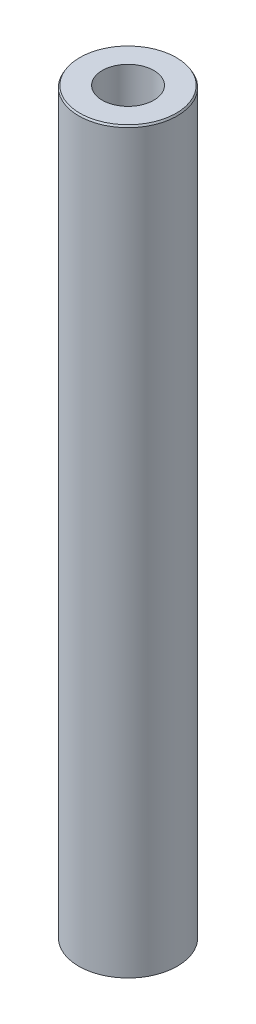
ISO-10303-21;
HEADER;
FILE_DESCRIPTION(('STEP AP214'),'2;1');
FILE_NAME('part.step','',(''),(''),'','','');
FILE_SCHEMA(('AUTOMOTIVE_DESIGN { 1 0 10303 214 1 1 1 1 }'));
ENDSEC;
DATA;
#1=APPLICATION_CONTEXT('core data for automotive mechanical design processes');
#2=APPLICATION_PROTOCOL_DEFINITION('international standard','automotive_design',2000,#1);
#3=PRODUCT_CONTEXT('',#1,'mechanical');
#4=PRODUCT('Part','Part','',(#3));
#5=PRODUCT_RELATED_PRODUCT_CATEGORY('part','',(#4));
#6=PRODUCT_DEFINITION_FORMATION('','',#4);
#7=PRODUCT_DEFINITION_CONTEXT('part definition',#1,'design');
#8=PRODUCT_DEFINITION('design','',#6,#7);
#9=PRODUCT_DEFINITION_SHAPE('','',#8);
#10=(LENGTH_UNIT() NAMED_UNIT(*) SI_UNIT(.MILLI.,.METRE.));
#11=(NAMED_UNIT(*) PLANE_ANGLE_UNIT() SI_UNIT($,.RADIAN.));
#12=(NAMED_UNIT(*) SI_UNIT($,.STERADIAN.) SOLID_ANGLE_UNIT());
#13=UNCERTAINTY_MEASURE_WITH_UNIT(LENGTH_MEASURE(1.E-05),#10,'distance_accuracy_value','');
#14=(GEOMETRIC_REPRESENTATION_CONTEXT(3) GLOBAL_UNCERTAINTY_ASSIGNED_CONTEXT((#13)) GLOBAL_UNIT_ASSIGNED_CONTEXT((#10,
#11,#12)) REPRESENTATION_CONTEXT('',''));
#15=CARTESIAN_POINT('',(0.,0.,0.));
#16=DIRECTION('',(0.,0.,1.));
#17=DIRECTION('',(1.,0.,0.));
#18=AXIS2_PLACEMENT_3D('',#15,#16,#17);
#19=CARTESIAN_POINT('',(0.,600.,0.));
#20=DIRECTION('',(0.,-1.,0.));
#21=DIRECTION('',(0.,0.,-1.));
#22=AXIS2_PLACEMENT_3D('',#19,#20,#21);
#23=CYLINDRICAL_SURFACE('',#22,40.);
#24=CARTESIAN_POINT('',(0.,598.524849327347,0.));
#25=DIRECTION('',(0.,1.,0.));
#26=DIRECTION('',(0.,0.,1.));
#27=AXIS2_PLACEMENT_3D('',#24,#25,#26);
#28=CIRCLE('',#27,40.);
#29=CARTESIAN_POINT('',(0.,598.524849327347,-40.));
#30=VERTEX_POINT('',#29);
#31=EDGE_CURVE('E50',#30,#30,#28,.F.);
#32=ORIENTED_EDGE('',*,*,#31,.T.);
#33=EDGE_LOOP('',(#32));
#34=FACE_BOUND('',#33,.T.);
#35=CARTESIAN_POINT('',(0.,0.851678637951547,0.));
#36=DIRECTION('',(0.,1.,0.));
#37=DIRECTION('',(0.,0.,1.));
#38=AXIS2_PLACEMENT_3D('',#35,#36,#37);
#39=CIRCLE('',#38,40.);
#40=CARTESIAN_POINT('',(0.,0.851678637951547,40.));
#41=VERTEX_POINT('',#40);
#42=EDGE_CURVE('E51',#41,#41,#39,.T.);
#43=ORIENTED_EDGE('',*,*,#42,.T.);
#44=EDGE_LOOP('',(#43));
#45=FACE_BOUND('',#44,.T.);
#46=ADVANCED_FACE('F39',(#34,#45),#23,.T.);
#47=CARTESIAN_POINT('',(0.,600.,0.));
#48=DIRECTION('',(0.,1.,0.));
#49=DIRECTION('',(0.,0.,1.));
#50=AXIS2_PLACEMENT_3D('',#47,#48,#49);
#51=PLANE('',#50);
#52=CARTESIAN_POINT('',(0.,600.,0.));
#53=DIRECTION('',(0.,1.,0.));
#54=DIRECTION('',(0.,0.,1.));
#55=AXIS2_PLACEMENT_3D('',#52,#53,#54);
#56=CIRCLE('',#55,39.1483213620484);
#57=CARTESIAN_POINT('',(0.,600.,-39.1483213620484));
#58=VERTEX_POINT('',#57);
#59=EDGE_CURVE('E54',#58,#58,#56,.T.);
#60=ORIENTED_EDGE('',*,*,#59,.T.);
#61=EDGE_LOOP('',(#60));
#62=FACE_BOUND('',#61,.T.);
#63=CARTESIAN_POINT('',(0.,600.,0.));
#64=DIRECTION('',(0.,1.,0.));
#65=DIRECTION('',(0.,0.,1.));
#66=AXIS2_PLACEMENT_3D('',#63,#64,#65);
#67=CIRCLE('',#66,20.9355033092453);
#68=CARTESIAN_POINT('',(0.,600.,20.9355033092453));
#69=VERTEX_POINT('',#68);
#70=EDGE_CURVE('E58',#69,#69,#67,.T.);
#71=ORIENTED_EDGE('',*,*,#70,.F.);
#72=EDGE_LOOP('',(#71));
#73=FACE_BOUND('',#72,.T.);
#74=ADVANCED_FACE('F69',(#62,#73),#51,.T.);
#75=CARTESIAN_POINT('',(0.,0.,0.));
#76=DIRECTION('',(0.,1.,0.));
#77=DIRECTION('',(0.,0.,1.));
#78=AXIS2_PLACEMENT_3D('',#75,#76,#77);
#79=PLANE('',#78);
#80=CARTESIAN_POINT('',(0.,0.,0.));
#81=DIRECTION('',(0.,1.,0.));
#82=DIRECTION('',(0.,0.,1.));
#83=AXIS2_PLACEMENT_3D('',#80,#81,#82);
#84=CIRCLE('',#83,38.524849327347);
#85=CARTESIAN_POINT('',(0.,0.,38.524849327347));
#86=VERTEX_POINT('',#85);
#87=EDGE_CURVE('E10',#86,#86,#84,.F.);
#88=ORIENTED_EDGE('',*,*,#87,.T.);
#89=EDGE_LOOP('',(#88));
#90=FACE_BOUND('',#89,.T.);
#91=CARTESIAN_POINT('',(0.,0.,0.));
#92=DIRECTION('',(0.,1.,0.));
#93=DIRECTION('',(0.,0.,1.));
#94=AXIS2_PLACEMENT_3D('',#91,#92,#93);
#95=CIRCLE('',#94,20.9355033092453);
#96=CARTESIAN_POINT('',(0.,0.,20.9355033092453));
#97=VERTEX_POINT('',#96);
#98=EDGE_CURVE('E63',#97,#97,#95,.T.);
#99=ORIENTED_EDGE('',*,*,#98,.T.);
#100=EDGE_LOOP('',(#99));
#101=FACE_BOUND('',#100,.T.);
#102=ADVANCED_FACE('F75',(#90,#101),#79,.F.);
#103=CARTESIAN_POINT('',(0.,600.,0.));
#104=DIRECTION('',(0.,-1.,0.));
#105=DIRECTION('',(0.,0.,-1.));
#106=AXIS2_PLACEMENT_3D('',#103,#104,#105);
#107=CYLINDRICAL_SURFACE('',#106,20.9355033092453);
#108=ORIENTED_EDGE('',*,*,#70,.T.);
#109=EDGE_LOOP('',(#108));
#110=FACE_BOUND('',#109,.T.);
#111=ORIENTED_EDGE('',*,*,#98,.F.);
#112=EDGE_LOOP('',(#111));
#113=FACE_BOUND('',#112,.T.);
#114=ADVANCED_FACE('F70',(#110,#113),#107,.F.);
#115=CARTESIAN_POINT('',(0.,600.,0.));
#116=DIRECTION('',(0.,-1.,0.));
#117=DIRECTION('',(0.,0.,-1.));
#118=AXIS2_PLACEMENT_3D('',#115,#116,#117);
#119=CONICAL_SURFACE('',#118,39.1483213620484,0.523598775598306);
#120=CARTESIAN_POINT('',(0.,598.524849327347,-40.));
#121=CARTESIAN_POINT('',(0.,598.540215480187,-39.9911283475214));
#122=CARTESIAN_POINT('',(0.,598.555581633027,-39.9822566950427));
#123=CARTESIAN_POINT('',(0.,598.586313938707,-39.9645133900854));
#124=CARTESIAN_POINT('',(0.,598.601680091547,-39.9556417376067));
#125=CARTESIAN_POINT('',(0.,598.632412397228,-39.9378984326494));
#126=CARTESIAN_POINT('',(0.,598.647778550068,-39.9290267801707));
#127=CARTESIAN_POINT('',(0.,598.678510855748,-39.9112834752134));
#128=CARTESIAN_POINT('',(0.,598.693877008588,-39.9024118227348));
#129=CARTESIAN_POINT('',(0.,598.724609314268,-39.8846685177774));
#130=CARTESIAN_POINT('',(0.,598.739975467109,-39.8757968652987));
#131=CARTESIAN_POINT('',(0.,598.770707772789,-39.8580535603414));
#132=CARTESIAN_POINT('',(0.,598.786073925629,-39.8491819078628));
#133=CARTESIAN_POINT('',(0.,598.816806231309,-39.8314386029054));
#134=CARTESIAN_POINT('',(0.,598.832172384149,-39.8225669504268));
#135=CARTESIAN_POINT('',(0.,598.86290468983,-39.8048236454695));
#136=CARTESIAN_POINT('',(0.,598.87827084267,-39.7959519929908));
#137=CARTESIAN_POINT('',(0.,598.90900314835,-39.7782086880335));
#138=CARTESIAN_POINT('',(0.,598.92436930119,-39.7693370355548));
#139=CARTESIAN_POINT('',(0.,598.955101606871,-39.7515937305975));
#140=CARTESIAN_POINT('',(0.,598.970467759711,-39.7427220781188));
#141=CARTESIAN_POINT('',(0.,599.001200065391,-39.7249787731615));
#142=CARTESIAN_POINT('',(0.,599.016566218231,-39.7161071206828));
#143=CARTESIAN_POINT('',(0.,599.047298523911,-39.6983638157255));
#144=CARTESIAN_POINT('',(0.,599.062664676752,-39.6894921632468));
#145=CARTESIAN_POINT('',(0.,599.093396982432,-39.6717488582895));
#146=CARTESIAN_POINT('',(0.,599.108763135272,-39.6628772058109));
#147=CARTESIAN_POINT('',(0.,599.139495440952,-39.6451339008535));
#148=CARTESIAN_POINT('',(0.,599.154861593792,-39.6362622483749));
#149=CARTESIAN_POINT('',(0.,599.185593899473,-39.6185189434175));
#150=CARTESIAN_POINT('',(0.,599.200960052313,-39.6096472909389));
#151=CARTESIAN_POINT('',(0.,599.231692357993,-39.5919039859815));
#152=CARTESIAN_POINT('',(0.,599.247058510833,-39.5830323335029));
#153=CARTESIAN_POINT('',(0.,599.277790816513,-39.5652890285456));
#154=CARTESIAN_POINT('',(0.,599.293156969354,-39.5564173760669));
#155=CARTESIAN_POINT('',(0.,599.323889275034,-39.5386740711096));
#156=CARTESIAN_POINT('',(0.,599.339255427874,-39.5298024186309));
#157=CARTESIAN_POINT('',(0.,599.369987733554,-39.5120591136736));
#158=CARTESIAN_POINT('',(0.,599.385353886394,-39.5031874611949));
#159=CARTESIAN_POINT('',(0.,599.416086192075,-39.4854441562376));
#160=CARTESIAN_POINT('',(0.,599.431452344915,-39.4765725037589));
#161=CARTESIAN_POINT('',(0.,599.462184650595,-39.4588291988016));
#162=CARTESIAN_POINT('',(0.,599.477550803435,-39.4499575463229));
#163=CARTESIAN_POINT('',(0.,599.508283109115,-39.4322142413656));
#164=CARTESIAN_POINT('',(0.,599.523649261956,-39.423342588887));
#165=CARTESIAN_POINT('',(0.,599.554381567636,-39.4055992839296));
#166=CARTESIAN_POINT('',(0.,599.569747720476,-39.396727631451));
#167=CARTESIAN_POINT('',(0.,599.600480026156,-39.3789843264936));
#168=CARTESIAN_POINT('',(0.,599.615846178996,-39.370112674015));
#169=CARTESIAN_POINT('',(0.,599.646578484677,-39.3523693690576));
#170=CARTESIAN_POINT('',(0.,599.661944637517,-39.343497716579));
#171=CARTESIAN_POINT('',(0.,599.692676943197,-39.3257544116217));
#172=CARTESIAN_POINT('',(0.,599.708043096037,-39.316882759143));
#173=CARTESIAN_POINT('',(0.,599.738775401718,-39.2991394541857));
#174=CARTESIAN_POINT('',(0.,599.754141554558,-39.290267801707));
#175=CARTESIAN_POINT('',(0.,599.784873860238,-39.2725244967497));
#176=CARTESIAN_POINT('',(0.,599.800240013078,-39.263652844271));
#177=CARTESIAN_POINT('',(0.,599.830972318758,-39.2459095393137));
#178=CARTESIAN_POINT('',(0.,599.846338471599,-39.237037886835));
#179=CARTESIAN_POINT('',(0.,599.877070777279,-39.2192945818777));
#180=CARTESIAN_POINT('',(0.,599.892436930119,-39.210422929399));
#181=CARTESIAN_POINT('',(0.,599.923169235799,-39.1926796244417));
#182=CARTESIAN_POINT('',(0.,599.938535388639,-39.1838079719631));
#183=CARTESIAN_POINT('',(0.,599.96926769432,-39.1660646670057));
#184=CARTESIAN_POINT('',(0.,599.98463384716,-39.1571930145271));
#185=CARTESIAN_POINT('',(0.,600.,-39.1483213620484));
#186=B_SPLINE_CURVE_WITH_KNOTS('',3,(#120,#121,#122,#123,#124,#125,#126,#127,#128,#129,#130,
#131,#132,#133,#134,#135,#136,#137,#138,#139,#140,#141,#142,#143,#144,#145,#146,#147,#148,#149,
#150,#151,#152,#153,#154,#155,#156,#157,#158,#159,#160,#161,#162,#163,#164,#165,#166,#167,#168,
#169,#170,#171,#172,#173,#174,#175,#176,#177,#178,#179,#180,#181,#182,#183,#184,#185),
.UNSPECIFIED.,.F.,.F.,(4,2,2,2,2,2,2,2,2,2,2,2,2,2,2,2,2,2,2,2,2,2,2,2,2,2,2,2,2,2,2,2,4),(0.,
0.0532299148719991,0.106459829743995,0.15968974461599,0.21291965948799,0.266149574359889,
0.319379489231885,0.372609404103884,0.42583931897588,0.479069233847875,0.532299148719778,
0.585529063591774,0.63875897846377,0.691988893335769,0.745218808207668,0.798448723079667,
0.851678637951663,0.904908552823659,0.958138467695658,1.01136838256756,1.06459829743955,
1.11782821231155,1.17105812718355,1.22428804205545,1.27751795692745,1.33074787179944,
1.38397778667144,1.43720770154344,1.49043761641534,1.54366753128733,1.59689744615933,
1.65012736103133,1.70335727590332),.UNSPECIFIED.);
#187=EDGE_CURVE('BSEAM81',#30,#58,#186,.T.);
#188=ORIENTED_EDGE('',*,*,#31,.F.);
#189=ORIENTED_EDGE('',*,*,#59,.F.);
#190=ORIENTED_EDGE('',*,*,#187,.T.);
#191=ORIENTED_EDGE('',*,*,#187,.F.);
#192=EDGE_LOOP('',(#188,#190,#189,#191));
#193=FACE_BOUND('',#192,.T.);
#194=ADVANCED_FACE('F81',(#193),#119,.T.);
#195=CARTESIAN_POINT('',(0.,0.851678637951547,0.));
#196=DIRECTION('',(0.,1.,0.));
#197=DIRECTION('',(0.,0.,1.));
#198=AXIS2_PLACEMENT_3D('',#195,#196,#197);
#199=CONICAL_SURFACE('',#198,40.,1.04719755119657);
#200=ORIENTED_EDGE('',*,*,#87,.F.);
#201=EDGE_LOOP('',(#200));
#202=FACE_BOUND('',#201,.T.);
#203=ORIENTED_EDGE('',*,*,#42,.F.);
#204=EDGE_LOOP('',(#203));
#205=FACE_BOUND('',#204,.T.);
#206=ADVANCED_FACE('F45',(#202,#205),#199,.T.);
#207=CLOSED_SHELL('',(#46,#74,#102,#114,#194,#206));
#208=MANIFOLD_SOLID_BREP('B2',#207);
#209=ADVANCED_BREP_SHAPE_REPRESENTATION('',(#18,#208),#14);
#210=SHAPE_DEFINITION_REPRESENTATION(#9,#209);
ENDSEC;
END-ISO-10303-21;
